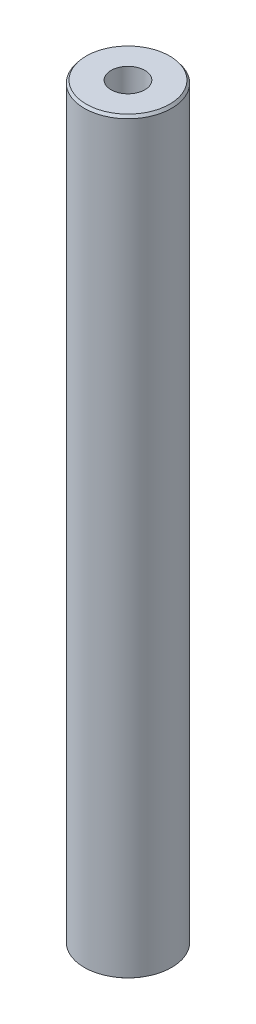
ISO-10303-21;
HEADER;
FILE_DESCRIPTION(('STEP AP214'),'2;1');
FILE_NAME('part.step','',(''),(''),'','','');
FILE_SCHEMA(('AUTOMOTIVE_DESIGN { 1 0 10303 214 1 1 1 1 }'));
ENDSEC;
DATA;
#1=APPLICATION_CONTEXT('core data for automotive mechanical design processes');
#2=APPLICATION_PROTOCOL_DEFINITION('international standard','automotive_design',2000,#1);
#3=PRODUCT_CONTEXT('',#1,'mechanical');
#4=PRODUCT('Part','Part','',(#3));
#5=PRODUCT_RELATED_PRODUCT_CATEGORY('part','',(#4));
#6=PRODUCT_DEFINITION_FORMATION('','',#4);
#7=PRODUCT_DEFINITION_CONTEXT('part definition',#1,'design');
#8=PRODUCT_DEFINITION('design','',#6,#7);
#9=PRODUCT_DEFINITION_SHAPE('','',#8);
#10=(LENGTH_UNIT() NAMED_UNIT(*) SI_UNIT(.MILLI.,.METRE.));
#11=(NAMED_UNIT(*) PLANE_ANGLE_UNIT() SI_UNIT($,.RADIAN.));
#12=(NAMED_UNIT(*) SI_UNIT($,.STERADIAN.) SOLID_ANGLE_UNIT());
#13=UNCERTAINTY_MEASURE_WITH_UNIT(LENGTH_MEASURE(1.E-05),#10,'distance_accuracy_value','');
#14=(GEOMETRIC_REPRESENTATION_CONTEXT(3) GLOBAL_UNCERTAINTY_ASSIGNED_CONTEXT((#13)) GLOBAL_UNIT_ASSIGNED_CONTEXT((#10,
#11,#12)) REPRESENTATION_CONTEXT('',''));
#15=CARTESIAN_POINT('',(0.,0.,0.));
#16=DIRECTION('',(0.,0.,1.));
#17=DIRECTION('',(1.,0.,0.));
#18=AXIS2_PLACEMENT_3D('',#15,#16,#17);
#19=CARTESIAN_POINT('',(0.,600.,0.));
#20=DIRECTION('',(0.,-1.,0.));
#21=DIRECTION('',(0.,0.,-1.));
#22=AXIS2_PLACEMENT_3D('',#19,#20,#21);
#23=CYLINDRICAL_SURFACE('',#22,35.);
#24=CARTESIAN_POINT('',(0.,597.88409785349,0.));
#25=DIRECTION('',(0.,1.,0.));
#26=DIRECTION('',(0.,0.,1.));
#27=AXIS2_PLACEMENT_3D('',#24,#25,#26);
#28=CIRCLE('',#27,35.);
#29=CARTESIAN_POINT('',(0.,597.88409785349,35.));
#30=VERTEX_POINT('',#29);
#31=EDGE_CURVE('E50',#30,#30,#28,.F.);
#32=ORIENTED_EDGE('',*,*,#31,.T.);
#33=EDGE_LOOP('',(#32));
#34=FACE_BOUND('',#33,.T.);
#35=CARTESIAN_POINT('',(0.,1.55076543207999,0.));
#36=DIRECTION('',(0.,1.,0.));
#37=DIRECTION('',(0.,0.,1.));
#38=AXIS2_PLACEMENT_3D('',#35,#36,#37);
#39=CIRCLE('',#38,35.);
#40=CARTESIAN_POINT('',(0.,1.55076543207999,35.));
#41=VERTEX_POINT('',#40);
#42=EDGE_CURVE('E51',#41,#41,#39,.T.);
#43=ORIENTED_EDGE('',*,*,#42,.T.);
#44=EDGE_LOOP('',(#43));
#45=FACE_BOUND('',#44,.T.);
#46=ADVANCED_FACE('F39',(#34,#45),#23,.T.);
#47=CARTESIAN_POINT('',(0.,600.,0.));
#48=DIRECTION('',(0.,1.,0.));
#49=DIRECTION('',(0.,0.,1.));
#50=AXIS2_PLACEMENT_3D('',#47,#48,#49);
#51=PLANE('',#50);
#52=CARTESIAN_POINT('',(0.,600.,0.));
#53=DIRECTION('',(0.,1.,0.));
#54=DIRECTION('',(0.,0.,1.));
#55=AXIS2_PLACEMENT_3D('',#52,#53,#54);
#56=CIRCLE('',#55,33.4492345679201);
#57=CARTESIAN_POINT('',(0.,600.,33.4492345679201));
#58=VERTEX_POINT('',#57);
#59=EDGE_CURVE('E54',#58,#58,#56,.T.);
#60=ORIENTED_EDGE('',*,*,#59,.T.);
#61=EDGE_LOOP('',(#60));
#62=FACE_BOUND('',#61,.T.);
#63=CARTESIAN_POINT('',(0.,600.,0.));
#64=DIRECTION('',(0.,1.,0.));
#65=DIRECTION('',(0.,0.,1.));
#66=AXIS2_PLACEMENT_3D('',#63,#64,#65);
#67=CIRCLE('',#66,13.5303908188073);
#68=CARTESIAN_POINT('',(0.,600.,13.5303908188073));
#69=VERTEX_POINT('',#68);
#70=EDGE_CURVE('E58',#69,#69,#67,.T.);
#71=ORIENTED_EDGE('',*,*,#70,.F.);
#72=EDGE_LOOP('',(#71));
#73=FACE_BOUND('',#72,.T.);
#74=ADVANCED_FACE('F69',(#62,#73),#51,.T.);
#75=CARTESIAN_POINT('',(0.,0.,0.));
#76=DIRECTION('',(0.,1.,0.));
#77=DIRECTION('',(0.,0.,1.));
#78=AXIS2_PLACEMENT_3D('',#75,#76,#77);
#79=PLANE('',#78);
#80=CARTESIAN_POINT('',(0.,0.,0.));
#81=DIRECTION('',(0.,1.,0.));
#82=DIRECTION('',(0.,0.,1.));
#83=AXIS2_PLACEMENT_3D('',#80,#81,#82);
#84=CIRCLE('',#83,32.8840978534899);
#85=CARTESIAN_POINT('',(0.,0.,32.8840978534899));
#86=VERTEX_POINT('',#85);
#87=EDGE_CURVE('E10',#86,#86,#84,.F.);
#88=ORIENTED_EDGE('',*,*,#87,.T.);
#89=EDGE_LOOP('',(#88));
#90=FACE_BOUND('',#89,.T.);
#91=CARTESIAN_POINT('',(0.,0.,0.));
#92=DIRECTION('',(0.,1.,0.));
#93=DIRECTION('',(0.,0.,1.));
#94=AXIS2_PLACEMENT_3D('',#91,#92,#93);
#95=CIRCLE('',#94,13.5303908188073);
#96=CARTESIAN_POINT('',(0.,0.,13.5303908188073));
#97=VERTEX_POINT('',#96);
#98=EDGE_CURVE('E63',#97,#97,#95,.T.);
#99=ORIENTED_EDGE('',*,*,#98,.T.);
#100=EDGE_LOOP('',(#99));
#101=FACE_BOUND('',#100,.T.);
#102=ADVANCED_FACE('F75',(#90,#101),#79,.F.);
#103=CARTESIAN_POINT('',(0.,600.,0.));
#104=DIRECTION('',(0.,-1.,0.));
#105=DIRECTION('',(0.,0.,-1.));
#106=AXIS2_PLACEMENT_3D('',#103,#104,#105);
#107=CYLINDRICAL_SURFACE('',#106,13.5303908188073);
#108=ORIENTED_EDGE('',*,*,#70,.T.);
#109=EDGE_LOOP('',(#108));
#110=FACE_BOUND('',#109,.T.);
#111=ORIENTED_EDGE('',*,*,#98,.F.);
#112=EDGE_LOOP('',(#111));
#113=FACE_BOUND('',#112,.T.);
#114=ADVANCED_FACE('F70',(#110,#113),#107,.F.);
#115=CARTESIAN_POINT('',(0.,600.,0.));
#116=DIRECTION('',(0.,-1.,0.));
#117=DIRECTION('',(0.,0.,-1.));
#118=AXIS2_PLACEMENT_3D('',#115,#116,#117);
#119=CONICAL_SURFACE('',#118,33.4492345679201,0.632473364311227);
#120=ORIENTED_EDGE('',*,*,#31,.F.);
#121=EDGE_LOOP('',(#120));
#122=FACE_BOUND('',#121,.T.);
#123=ORIENTED_EDGE('',*,*,#59,.F.);
#124=EDGE_LOOP('',(#123));
#125=FACE_BOUND('',#124,.T.);
#126=ADVANCED_FACE('F81',(#122,#125),#119,.T.);
#127=CARTESIAN_POINT('',(0.,1.55076543207999,0.));
#128=DIRECTION('',(0.,1.,0.));
#129=DIRECTION('',(0.,0.,1.));
#130=AXIS2_PLACEMENT_3D('',#127,#128,#129);
#131=CONICAL_SURFACE('',#130,35.,0.938322962483679);
#132=ORIENTED_EDGE('',*,*,#87,.F.);
#133=EDGE_LOOP('',(#132));
#134=FACE_BOUND('',#133,.T.);
#135=ORIENTED_EDGE('',*,*,#42,.F.);
#136=EDGE_LOOP('',(#135));
#137=FACE_BOUND('',#136,.T.);
#138=ADVANCED_FACE('F45',(#134,#137),#131,.T.);
#139=CLOSED_SHELL('',(#46,#74,#102,#114,#126,#138));
#140=MANIFOLD_SOLID_BREP('B2',#139);
#141=ADVANCED_BREP_SHAPE_REPRESENTATION('',(#18,#140),#14);
#142=SHAPE_DEFINITION_REPRESENTATION(#9,#141);
ENDSEC;
END-ISO-10303-21;
